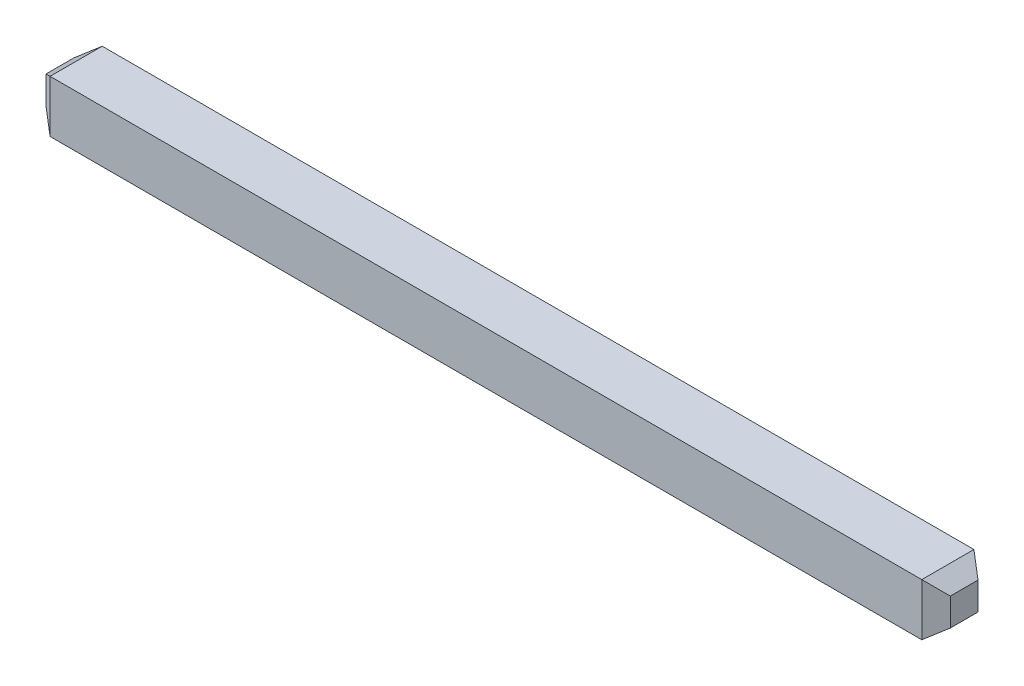
ISO-10303-21;
HEADER;
FILE_DESCRIPTION(('STEP AP214'),'2;1');
FILE_NAME('part.step','',(''),(''),'','','');
FILE_SCHEMA(('AUTOMOTIVE_DESIGN { 1 0 10303 214 1 1 1 1 }'));
ENDSEC;
DATA;
#1=APPLICATION_CONTEXT('core data for automotive mechanical design processes');
#2=APPLICATION_PROTOCOL_DEFINITION('international standard','automotive_design',2000,#1);
#3=PRODUCT_CONTEXT('',#1,'mechanical');
#4=PRODUCT('Part','Part','',(#3));
#5=PRODUCT_RELATED_PRODUCT_CATEGORY('part','',(#4));
#6=PRODUCT_DEFINITION_FORMATION('','',#4);
#7=PRODUCT_DEFINITION_CONTEXT('part definition',#1,'design');
#8=PRODUCT_DEFINITION('design','',#6,#7);
#9=PRODUCT_DEFINITION_SHAPE('','',#8);
#10=(LENGTH_UNIT() NAMED_UNIT(*) SI_UNIT(.MILLI.,.METRE.));
#11=(NAMED_UNIT(*) PLANE_ANGLE_UNIT() SI_UNIT($,.RADIAN.));
#12=(NAMED_UNIT(*) SI_UNIT($,.STERADIAN.) SOLID_ANGLE_UNIT());
#13=UNCERTAINTY_MEASURE_WITH_UNIT(LENGTH_MEASURE(1.E-05),#10,'distance_accuracy_value','');
#14=(GEOMETRIC_REPRESENTATION_CONTEXT(3) GLOBAL_UNCERTAINTY_ASSIGNED_CONTEXT((#13)) GLOBAL_UNIT_ASSIGNED_CONTEXT((#10,
#11,#12)) REPRESENTATION_CONTEXT('',''));
#15=CARTESIAN_POINT('',(0.,0.,0.));
#16=DIRECTION('',(0.,0.,1.));
#17=DIRECTION('',(1.,0.,0.));
#18=AXIS2_PLACEMENT_3D('',#15,#16,#17);
#19=CARTESIAN_POINT('',(-2.4,3.525,-34.29));
#20=DIRECTION('',(0.6,0.8,0.));
#21=DIRECTION('',(-0.8,0.6,0.));
#22=AXIS2_PLACEMENT_3D('',#19,#20,#21);
#23=PLANE('',#22);
#24=DIRECTION('',(0.,0.,1.));
#25=VECTOR('',#24,1.);
#26=CARTESIAN_POINT('',(-2.3,3.45,-34.29));
#27=LINE('',#26,#25);
#28=CARTESIAN_POINT('',(-2.29999999999978,3.45,-34.6099999999997));
#29=VERTEX_POINT('',#28);
#30=CARTESIAN_POINT('',(-2.29999999999978,3.45,-33.9700000000003));
#31=VERTEX_POINT('',#30);
#32=EDGE_CURVE('E105',#29,#31,#27,.T.);
#33=ORIENTED_EDGE('',*,*,#32,.T.);
#34=DIRECTION('',(0.685994340575991,-0.514495755427523,0.514495755419589));
#35=VECTOR('',#34,1.);
#36=CARTESIAN_POINT('',(-2.50000000000086,3.6,-34.1199999999988));
#37=LINE('',#36,#35);
#38=CARTESIAN_POINT('',(-2.50000000000022,3.6,-34.1199999999997));
#39=VERTEX_POINT('',#38);
#40=EDGE_CURVE('E92',#39,#31,#37,.T.);
#41=ORIENTED_EDGE('',*,*,#40,.F.);
#42=DIRECTION('',(0.,0.,-1.));
#43=VECTOR('',#42,1.);
#44=CARTESIAN_POINT('',(-2.5,3.6,-34.29));
#45=LINE('',#44,#43);
#46=CARTESIAN_POINT('',(-2.50000000000043,3.6,-34.4600000000006));
#47=VERTEX_POINT('',#46);
#48=EDGE_CURVE('E79',#39,#47,#45,.T.);
#49=ORIENTED_EDGE('',*,*,#48,.T.);
#50=DIRECTION('',(0.68599434057595,-0.514495755427527,-0.51449575541964));
#51=VECTOR('',#50,1.);
#52=CARTESIAN_POINT('',(-2.50000000000086,3.6,-34.4600000000012));
#53=LINE('',#52,#51);
#54=EDGE_CURVE('E20',#47,#29,#53,.T.);
#55=ORIENTED_EDGE('',*,*,#54,.T.);
#56=EDGE_LOOP('',(#33,#41,#49,#55));
#57=FACE_BOUND('',#56,.T.);
#58=ADVANCED_FACE('F17',(#57),#23,.F.);
#59=CARTESIAN_POINT('',(8.5,3.525,-34.29));
#60=DIRECTION('',(-0.6,0.8,0.));
#61=DIRECTION('',(-0.8,-0.6,0.));
#62=AXIS2_PLACEMENT_3D('',#59,#60,#61);
#63=PLANE('',#62);
#64=DIRECTION('',(0.,0.,-1.));
#65=VECTOR('',#64,1.);
#66=CARTESIAN_POINT('',(8.6,3.6,-34.29));
#67=LINE('',#66,#65);
#68=CARTESIAN_POINT('',(8.60000000000043,3.6,-34.1199999999994));
#69=VERTEX_POINT('',#68);
#70=CARTESIAN_POINT('',(8.60000000000021,3.6,-34.4600000000003));
#71=VERTEX_POINT('',#70);
#72=EDGE_CURVE('E114',#69,#71,#67,.T.);
#73=ORIENTED_EDGE('',*,*,#72,.F.);
#74=DIRECTION('',(0.68599434057599,0.514495755427524,-0.51449575541959));
#75=VECTOR('',#74,1.);
#76=CARTESIAN_POINT('',(8.39999999999913,3.45,-33.9700000000012));
#77=LINE('',#76,#75);
#78=CARTESIAN_POINT('',(8.39999999999989,3.45,-33.9700000000001));
#79=VERTEX_POINT('',#78);
#80=EDGE_CURVE('E109',#79,#69,#77,.T.);
#81=ORIENTED_EDGE('',*,*,#80,.F.);
#82=DIRECTION('',(0.,0.,1.));
#83=VECTOR('',#82,1.);
#84=CARTESIAN_POINT('',(8.4,3.45,-34.29));
#85=LINE('',#84,#83);
#86=CARTESIAN_POINT('',(8.39999999999978,3.45,-34.6099999999997));
#87=VERTEX_POINT('',#86);
#88=EDGE_CURVE('E103',#79,#87,#85,.F.);
#89=ORIENTED_EDGE('',*,*,#88,.T.);
#90=DIRECTION('',(0.685994340575951,0.514495755427526,0.514495755419639));
#91=VECTOR('',#90,1.);
#92=CARTESIAN_POINT('',(8.39999999999913,3.45,-34.6099999999988));
#93=LINE('',#92,#91);
#94=EDGE_CURVE('E107',#87,#71,#93,.T.);
#95=ORIENTED_EDGE('',*,*,#94,.T.);
#96=EDGE_LOOP('',(#73,#81,#89,#95));
#97=FACE_BOUND('',#96,.T.);
#98=ADVANCED_FACE('F175',(#97),#63,.F.);
#99=CARTESIAN_POINT('',(-2.4,3.77,-34.535));
#100=DIRECTION('',(0.5999999999908,0.,0.8000000000069));
#101=DIRECTION('',(0.8000000000069,0.,-0.5999999999908));
#102=AXIS2_PLACEMENT_3D('',#99,#100,#101);
#103=PLANE('',#102);
#104=DIRECTION('',(0.,1.,0.));
#105=VECTOR('',#104,1.);
#106=CARTESIAN_POINT('',(-2.3,3.77,-34.61));
#107=LINE('',#106,#105);
#108=CARTESIAN_POINT('',(-2.29999999999957,4.09,-34.6099999999994));
#109=VERTEX_POINT('',#108);
#110=EDGE_CURVE('E88',#109,#29,#107,.F.);
#111=ORIENTED_EDGE('',*,*,#110,.T.);
#112=ORIENTED_EDGE('',*,*,#54,.F.);
#113=DIRECTION('',(0.,1.,0.));
#114=VECTOR('',#113,1.);
#115=CARTESIAN_POINT('',(-2.5,3.77,-34.46));
#116=LINE('',#115,#114);
#117=CARTESIAN_POINT('',(-2.50000000000043,3.94,-34.4600000000006));
#118=VERTEX_POINT('',#117);
#119=EDGE_CURVE('E85',#47,#118,#116,.T.);
#120=ORIENTED_EDGE('',*,*,#119,.T.);
#121=DIRECTION('',(-0.685994340570039,-0.514495755427529,0.51449575542752));
#122=VECTOR('',#121,1.);
#123=CARTESIAN_POINT('',(-2.3,4.09,-34.61));
#124=LINE('',#123,#122);
#125=EDGE_CURVE('E126',#109,#118,#124,.T.);
#126=ORIENTED_EDGE('',*,*,#125,.F.);
#127=EDGE_LOOP('',(#111,#112,#120,#126));
#128=FACE_BOUND('',#127,.T.);
#129=ADVANCED_FACE('F84',(#128),#103,.F.);
#130=CARTESIAN_POINT('',(-2.5,3.77,-34.29));
#131=DIRECTION('',(1.,0.,0.));
#132=DIRECTION('',(0.,0.,-1.));
#133=AXIS2_PLACEMENT_3D('',#130,#131,#132);
#134=PLANE('',#133);
#135=DIRECTION('',(0.,1.,0.));
#136=VECTOR('',#135,1.);
#137=CARTESIAN_POINT('',(-2.50000000000086,3.77,-34.1199999999988));
#138=LINE('',#137,#136);
#139=CARTESIAN_POINT('',(-2.50000000000022,3.94,-34.1199999999997));
#140=VERTEX_POINT('',#139);
#141=EDGE_CURVE('E94',#140,#39,#138,.F.);
#142=ORIENTED_EDGE('',*,*,#141,.F.);
#143=DIRECTION('',(0.,0.,1.));
#144=VECTOR('',#143,1.);
#145=CARTESIAN_POINT('',(-2.5,3.94,-34.29));
#146=LINE('',#145,#144);
#147=EDGE_CURVE('E98',#118,#140,#146,.T.);
#148=ORIENTED_EDGE('',*,*,#147,.F.);
#149=ORIENTED_EDGE('',*,*,#119,.F.);
#150=ORIENTED_EDGE('',*,*,#48,.F.);
#151=EDGE_LOOP('',(#142,#148,#149,#150));
#152=FACE_BOUND('',#151,.T.);
#153=ADVANCED_FACE('F96',(#152),#134,.F.);
#154=CARTESIAN_POINT('',(-2.4,3.77,-34.045));
#155=DIRECTION('',(-0.599999999990736,0.,0.800000000006948));
#156=DIRECTION('',(0.800000000006948,0.,0.599999999990736));
#157=AXIS2_PLACEMENT_3D('',#154,#155,#156);
#158=PLANE('',#157);
#159=ORIENTED_EDGE('',*,*,#40,.T.);
#160=DIRECTION('',(0.,1.,0.));
#161=VECTOR('',#160,1.);
#162=CARTESIAN_POINT('',(-2.3,3.77,-33.97));
#163=LINE('',#162,#161);
#164=CARTESIAN_POINT('',(-2.29999999999956,4.09,-33.9700000000006));
#165=VERTEX_POINT('',#164);
#166=EDGE_CURVE('E132',#165,#31,#163,.F.);
#167=ORIENTED_EDGE('',*,*,#166,.F.);
#168=DIRECTION('',(0.685994340570039,0.514495755427529,0.51449575542752));
#169=VECTOR('',#168,1.);
#170=CARTESIAN_POINT('',(-2.5,3.94,-34.12));
#171=LINE('',#170,#169);
#172=EDGE_CURVE('E129',#140,#165,#171,.T.);
#173=ORIENTED_EDGE('',*,*,#172,.F.);
#174=ORIENTED_EDGE('',*,*,#141,.T.);
#175=EDGE_LOOP('',(#159,#167,#173,#174));
#176=FACE_BOUND('',#175,.T.);
#177=ADVANCED_FACE('F186',(#176),#158,.T.);
#178=CARTESIAN_POINT('',(3.05,3.45,-34.29));
#179=DIRECTION('',(0.,1.,0.));
#180=DIRECTION('',(0.,0.,1.));
#181=AXIS2_PLACEMENT_3D('',#178,#179,#180);
#182=PLANE('',#181);
#183=ORIENTED_EDGE('',*,*,#32,.F.);
#184=DIRECTION('',(1.,0.,0.));
#185=VECTOR('',#184,1.);
#186=CARTESIAN_POINT('',(3.05,3.45,-34.61));
#187=LINE('',#186,#185);
#188=EDGE_CURVE('E123',#29,#87,#187,.T.);
#189=ORIENTED_EDGE('',*,*,#188,.T.);
#190=ORIENTED_EDGE('',*,*,#88,.F.);
#191=DIRECTION('',(1.,0.,0.));
#192=VECTOR('',#191,1.);
#193=CARTESIAN_POINT('',(3.05,3.45,-33.97));
#194=LINE('',#193,#192);
#195=EDGE_CURVE('E135',#31,#79,#194,.T.);
#196=ORIENTED_EDGE('',*,*,#195,.F.);
#197=EDGE_LOOP('',(#183,#189,#190,#196));
#198=FACE_BOUND('',#197,.T.);
#199=ADVANCED_FACE('F179',(#198),#182,.F.);
#200=CARTESIAN_POINT('',(8.5,3.77,-34.535));
#201=DIRECTION('',(-0.5999999999908,0.,0.8000000000069));
#202=DIRECTION('',(0.8000000000069,0.,0.5999999999908));
#203=AXIS2_PLACEMENT_3D('',#200,#201,#202);
#204=PLANE('',#203);
#205=DIRECTION('',(0.,1.,0.));
#206=VECTOR('',#205,1.);
#207=CARTESIAN_POINT('',(8.6,3.77,-34.46));
#208=LINE('',#207,#206);
#209=CARTESIAN_POINT('',(8.60000000000043,3.94,-34.4600000000006));
#210=VERTEX_POINT('',#209);
#211=EDGE_CURVE('E117',#71,#210,#208,.T.);
#212=ORIENTED_EDGE('',*,*,#211,.F.);
#213=ORIENTED_EDGE('',*,*,#94,.F.);
#214=DIRECTION('',(0.,1.,0.));
#215=VECTOR('',#214,1.);
#216=CARTESIAN_POINT('',(8.4,3.77,-34.61));
#217=LINE('',#216,#215);
#218=CARTESIAN_POINT('',(8.39999999999957,4.09,-34.6099999999994));
#219=VERTEX_POINT('',#218);
#220=EDGE_CURVE('E120',#87,#219,#217,.T.);
#221=ORIENTED_EDGE('',*,*,#220,.T.);
#222=DIRECTION('',(-0.685994340570037,0.514495755427528,-0.514495755427522));
#223=VECTOR('',#222,1.);
#224=CARTESIAN_POINT('',(8.6,3.94,-34.46));
#225=LINE('',#224,#223);
#226=EDGE_CURVE('E140',#210,#219,#225,.T.);
#227=ORIENTED_EDGE('',*,*,#226,.F.);
#228=EDGE_LOOP('',(#212,#213,#221,#227));
#229=FACE_BOUND('',#228,.T.);
#230=ADVANCED_FACE('F167',(#229),#204,.F.);
#231=CARTESIAN_POINT('',(8.5,3.77,-34.045));
#232=DIRECTION('',(0.599999999990736,0.,0.800000000006948));
#233=DIRECTION('',(0.800000000006948,0.,-0.599999999990736));
#234=AXIS2_PLACEMENT_3D('',#231,#232,#233);
#235=PLANE('',#234);
#236=DIRECTION('',(0.685994340570037,-0.514495755427528,-0.514495755427522));
#237=VECTOR('',#236,1.);
#238=CARTESIAN_POINT('',(8.4,4.09,-33.97));
#239=LINE('',#238,#237);
#240=CARTESIAN_POINT('',(8.39999999999956,4.09,-33.9700000000006));
#241=VERTEX_POINT('',#240);
#242=CARTESIAN_POINT('',(8.60000000000043,3.94,-34.1199999999994));
#243=VERTEX_POINT('',#242);
#244=EDGE_CURVE('E35',#241,#243,#239,.T.);
#245=ORIENTED_EDGE('',*,*,#244,.F.);
#246=DIRECTION('',(0.,1.,0.));
#247=VECTOR('',#246,1.);
#248=CARTESIAN_POINT('',(8.4,3.77,-33.97));
#249=LINE('',#248,#247);
#250=EDGE_CURVE('E138',#79,#241,#249,.T.);
#251=ORIENTED_EDGE('',*,*,#250,.F.);
#252=ORIENTED_EDGE('',*,*,#80,.T.);
#253=DIRECTION('',(0.,1.,0.));
#254=VECTOR('',#253,1.);
#255=CARTESIAN_POINT('',(8.6,3.77,-34.12));
#256=LINE('',#255,#254);
#257=EDGE_CURVE('E111',#243,#69,#256,.F.);
#258=ORIENTED_EDGE('',*,*,#257,.F.);
#259=EDGE_LOOP('',(#245,#251,#252,#258));
#260=FACE_BOUND('',#259,.T.);
#261=ADVANCED_FACE('F211',(#260),#235,.T.);
#262=CARTESIAN_POINT('',(8.6,3.77,-34.29));
#263=DIRECTION('',(1.,0.,0.));
#264=DIRECTION('',(0.,0.,-1.));
#265=AXIS2_PLACEMENT_3D('',#262,#263,#264);
#266=PLANE('',#265);
#267=ORIENTED_EDGE('',*,*,#211,.T.);
#268=DIRECTION('',(0.,0.,1.));
#269=VECTOR('',#268,1.);
#270=CARTESIAN_POINT('',(8.6,3.94,-34.29));
#271=LINE('',#270,#269);
#272=EDGE_CURVE('E144',#243,#210,#271,.F.);
#273=ORIENTED_EDGE('',*,*,#272,.F.);
#274=ORIENTED_EDGE('',*,*,#257,.T.);
#275=ORIENTED_EDGE('',*,*,#72,.T.);
#276=EDGE_LOOP('',(#267,#273,#274,#275));
#277=FACE_BOUND('',#276,.T.);
#278=ADVANCED_FACE('F172',(#277),#266,.T.);
#279=CARTESIAN_POINT('',(3.05,3.77,-34.61));
#280=DIRECTION('',(0.,0.,1.));
#281=DIRECTION('',(1.,0.,0.));
#282=AXIS2_PLACEMENT_3D('',#279,#280,#281);
#283=PLANE('',#282);
#284=ORIENTED_EDGE('',*,*,#110,.F.);
#285=DIRECTION('',(1.,0.,0.));
#286=VECTOR('',#285,1.);
#287=CARTESIAN_POINT('',(3.05,4.09,-34.61));
#288=LINE('',#287,#286);
#289=EDGE_CURVE('E147',#219,#109,#288,.F.);
#290=ORIENTED_EDGE('',*,*,#289,.F.);
#291=ORIENTED_EDGE('',*,*,#220,.F.);
#292=ORIENTED_EDGE('',*,*,#188,.F.);
#293=EDGE_LOOP('',(#284,#290,#291,#292));
#294=FACE_BOUND('',#293,.T.);
#295=ADVANCED_FACE('F181',(#294),#283,.F.);
#296=CARTESIAN_POINT('',(-2.4,4.015,-34.29));
#297=DIRECTION('',(-0.6,0.8,0.));
#298=DIRECTION('',(-0.8,-0.6,0.));
#299=AXIS2_PLACEMENT_3D('',#296,#297,#298);
#300=PLANE('',#299);
#301=ORIENTED_EDGE('',*,*,#172,.T.);
#302=DIRECTION('',(0.,0.,1.));
#303=VECTOR('',#302,1.);
#304=CARTESIAN_POINT('',(-2.3,4.09,-34.29));
#305=LINE('',#304,#303);
#306=EDGE_CURVE('E150',#109,#165,#305,.T.);
#307=ORIENTED_EDGE('',*,*,#306,.F.);
#308=ORIENTED_EDGE('',*,*,#125,.T.);
#309=ORIENTED_EDGE('',*,*,#147,.T.);
#310=EDGE_LOOP('',(#301,#307,#308,#309));
#311=FACE_BOUND('',#310,.T.);
#312=ADVANCED_FACE('F183',(#311),#300,.T.);
#313=CARTESIAN_POINT('',(3.05,3.77,-33.97));
#314=DIRECTION('',(0.,0.,1.));
#315=DIRECTION('',(1.,0.,0.));
#316=AXIS2_PLACEMENT_3D('',#313,#314,#315);
#317=PLANE('',#316);
#318=ORIENTED_EDGE('',*,*,#195,.T.);
#319=ORIENTED_EDGE('',*,*,#250,.T.);
#320=DIRECTION('',(1.,0.,0.));
#321=VECTOR('',#320,1.);
#322=CARTESIAN_POINT('',(3.05,4.09,-33.97));
#323=LINE('',#322,#321);
#324=EDGE_CURVE('E26',#165,#241,#323,.T.);
#325=ORIENTED_EDGE('',*,*,#324,.F.);
#326=ORIENTED_EDGE('',*,*,#166,.T.);
#327=EDGE_LOOP('',(#318,#319,#325,#326));
#328=FACE_BOUND('',#327,.T.);
#329=ADVANCED_FACE('F160',(#328),#317,.T.);
#330=CARTESIAN_POINT('',(8.5,4.015,-34.29));
#331=DIRECTION('',(0.6,0.8,0.));
#332=DIRECTION('',(-0.8,0.6,0.));
#333=AXIS2_PLACEMENT_3D('',#330,#331,#332);
#334=PLANE('',#333);
#335=ORIENTED_EDGE('',*,*,#244,.T.);
#336=ORIENTED_EDGE('',*,*,#272,.T.);
#337=ORIENTED_EDGE('',*,*,#226,.T.);
#338=DIRECTION('',(0.,0.,1.));
#339=VECTOR('',#338,1.);
#340=CARTESIAN_POINT('',(8.4,4.09,-34.29));
#341=LINE('',#340,#339);
#342=EDGE_CURVE('E11',#241,#219,#341,.F.);
#343=ORIENTED_EDGE('',*,*,#342,.F.);
#344=EDGE_LOOP('',(#335,#336,#337,#343));
#345=FACE_BOUND('',#344,.T.);
#346=ADVANCED_FACE('F163',(#345),#334,.T.);
#347=CARTESIAN_POINT('',(3.05,4.09,-34.29));
#348=DIRECTION('',(0.,1.,0.));
#349=DIRECTION('',(0.,0.,1.));
#350=AXIS2_PLACEMENT_3D('',#347,#348,#349);
#351=PLANE('',#350);
#352=ORIENTED_EDGE('',*,*,#324,.T.);
#353=ORIENTED_EDGE('',*,*,#342,.T.);
#354=ORIENTED_EDGE('',*,*,#289,.T.);
#355=ORIENTED_EDGE('',*,*,#306,.T.);
#356=EDGE_LOOP('',(#352,#353,#354,#355));
#357=FACE_BOUND('',#356,.T.);
#358=ADVANCED_FACE('F156',(#357),#351,.T.);
#359=CLOSED_SHELL('',(#58,#98,#129,#153,#177,#199,#230,#261,#278,#295,#312,#329,#346,#358));
#360=MANIFOLD_SOLID_BREP('B1',#359);
#361=ADVANCED_BREP_SHAPE_REPRESENTATION('',(#18,#360),#14);
#362=SHAPE_DEFINITION_REPRESENTATION(#9,#361);
ENDSEC;
END-ISO-10303-21;
